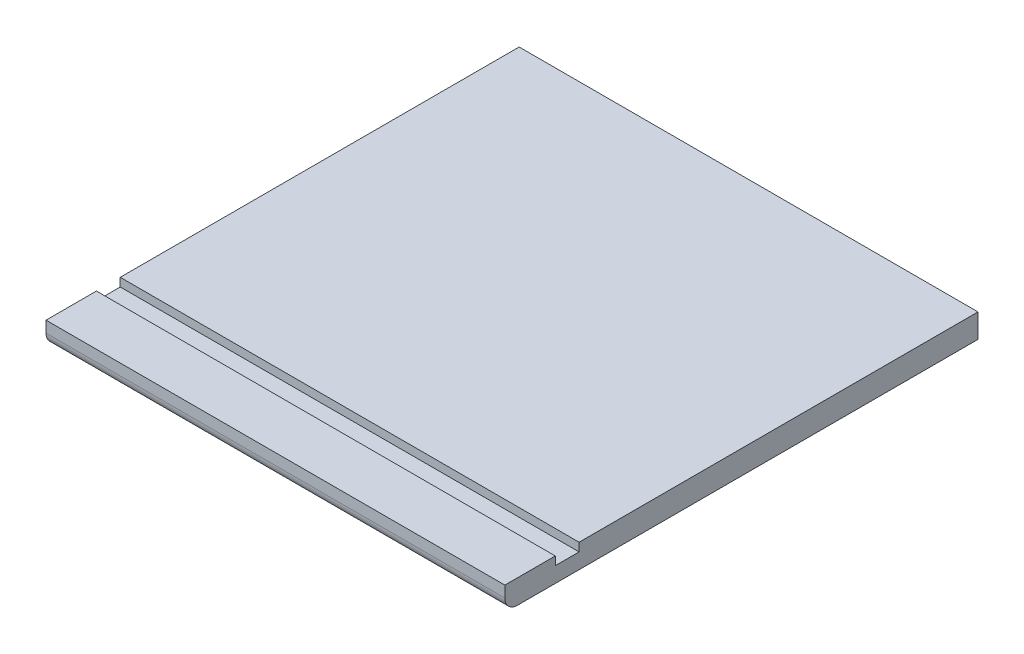
ISO-10303-21;
HEADER;
FILE_DESCRIPTION(('STEP AP214'),'2;1');
FILE_NAME('part.step','',(''),(''),'','','');
FILE_SCHEMA(('AUTOMOTIVE_DESIGN { 1 0 10303 214 1 1 1 1 }'));
ENDSEC;
DATA;
#1=APPLICATION_CONTEXT('core data for automotive mechanical design processes');
#2=APPLICATION_PROTOCOL_DEFINITION('international standard','automotive_design',2000,#1);
#3=PRODUCT_CONTEXT('',#1,'mechanical');
#4=PRODUCT('Part','Part','',(#3));
#5=PRODUCT_RELATED_PRODUCT_CATEGORY('part','',(#4));
#6=PRODUCT_DEFINITION_FORMATION('','',#4);
#7=PRODUCT_DEFINITION_CONTEXT('part definition',#1,'design');
#8=PRODUCT_DEFINITION('design','',#6,#7);
#9=PRODUCT_DEFINITION_SHAPE('','',#8);
#10=(LENGTH_UNIT() NAMED_UNIT(*) SI_UNIT(.MILLI.,.METRE.));
#11=(NAMED_UNIT(*) PLANE_ANGLE_UNIT() SI_UNIT($,.RADIAN.));
#12=(NAMED_UNIT(*) SI_UNIT($,.STERADIAN.) SOLID_ANGLE_UNIT());
#13=UNCERTAINTY_MEASURE_WITH_UNIT(LENGTH_MEASURE(1.E-05),#10,'distance_accuracy_value','');
#14=(GEOMETRIC_REPRESENTATION_CONTEXT(3) GLOBAL_UNCERTAINTY_ASSIGNED_CONTEXT((#13)) GLOBAL_UNIT_ASSIGNED_CONTEXT((#10,
#11,#12)) REPRESENTATION_CONTEXT('',''));
#15=CARTESIAN_POINT('',(0.,0.,0.));
#16=DIRECTION('',(0.,0.,1.));
#17=DIRECTION('',(1.,0.,0.));
#18=AXIS2_PLACEMENT_3D('',#15,#16,#17);
#19=CARTESIAN_POINT('',(0.,18.,0.));
#20=DIRECTION('',(0.,1.,0.));
#21=DIRECTION('',(0.,0.,1.));
#22=AXIS2_PLACEMENT_3D('',#19,#20,#21);
#23=PLANE('',#22);
#24=DIRECTION('',(1.,0.,0.));
#25=VECTOR('',#24,1.);
#26=CARTESIAN_POINT('',(346.7,18.,319.40000001));
#27=LINE('',#26,#25);
#28=CARTESIAN_POINT('',(0.,18.,319.40000001));
#29=VERTEX_POINT('',#28);
#30=CARTESIAN_POINT('',(346.7,18.,319.40000001));
#31=VERTEX_POINT('',#30);
#32=EDGE_CURVE('E121',#29,#31,#27,.T.);
#33=ORIENTED_EDGE('',*,*,#32,.F.);
#34=DIRECTION('',(0.,0.,1.));
#35=VECTOR('',#34,1.);
#36=CARTESIAN_POINT('',(0.,18.,0.));
#37=LINE('',#36,#35);
#38=CARTESIAN_POINT('',(0.,18.,357.50000001));
#39=VERTEX_POINT('',#38);
#40=EDGE_CURVE('E137',#29,#39,#37,.T.);
#41=ORIENTED_EDGE('',*,*,#40,.T.);
#42=DIRECTION('',(1.,0.,0.));
#43=VECTOR('',#42,1.);
#44=CARTESIAN_POINT('',(0.,18.,357.50000001));
#45=LINE('',#44,#43);
#46=CARTESIAN_POINT('',(346.7,18.,357.50000001));
#47=VERTEX_POINT('',#46);
#48=EDGE_CURVE('E136',#39,#47,#45,.T.);
#49=ORIENTED_EDGE('',*,*,#48,.T.);
#50=DIRECTION('',(0.,0.,-1.));
#51=VECTOR('',#50,1.);
#52=CARTESIAN_POINT('',(346.7,18.,0.));
#53=LINE('',#52,#51);
#54=EDGE_CURVE('E139',#47,#31,#53,.T.);
#55=ORIENTED_EDGE('',*,*,#54,.T.);
#56=EDGE_LOOP('',(#33,#41,#49,#55));
#57=FACE_BOUND('',#56,.T.);
#58=ADVANCED_FACE('F33',(#57),#23,.T.);
#59=CARTESIAN_POINT('',(0.,18.,0.));
#60=DIRECTION('',(1.,0.,0.));
#61=DIRECTION('',(0.,0.,-1.));
#62=AXIS2_PLACEMENT_3D('',#59,#60,#61);
#63=PLANE('',#62);
#64=DIRECTION('',(0.,0.,1.));
#65=VECTOR('',#64,1.);
#66=CARTESIAN_POINT('',(0.,0.,0.));
#67=LINE('',#66,#65);
#68=CARTESIAN_POINT('',(0.,0.,0.));
#69=VERTEX_POINT('',#68);
#70=CARTESIAN_POINT('',(0.,0.,347.97500001));
#71=VERTEX_POINT('',#70);
#72=EDGE_CURVE('E145',#69,#71,#67,.T.);
#73=ORIENTED_EDGE('',*,*,#72,.T.);
#74=CARTESIAN_POINT('',(0.,9.525,347.97500001));
#75=DIRECTION('',(1.,0.,0.));
#76=DIRECTION('',(0.,0.,-1.));
#77=AXIS2_PLACEMENT_3D('',#74,#75,#76);
#78=CIRCLE('',#77,9.525);
#79=CARTESIAN_POINT('',(0.,9.525,357.50000001));
#80=VERTEX_POINT('',#79);
#81=EDGE_CURVE('E11',#71,#80,#78,.F.);
#82=ORIENTED_EDGE('',*,*,#81,.T.);
#83=DIRECTION('',(0.,-1.,0.));
#84=VECTOR('',#83,1.);
#85=CARTESIAN_POINT('',(0.,18.,357.50000001));
#86=LINE('',#85,#84);
#87=EDGE_CURVE('E159',#39,#80,#86,.T.);
#88=ORIENTED_EDGE('',*,*,#87,.F.);
#89=ORIENTED_EDGE('',*,*,#40,.F.);
#90=DIRECTION('',(0.,1.,0.));
#91=VECTOR('',#90,1.);
#92=CARTESIAN_POINT('',(0.,11.65,319.40000001));
#93=LINE('',#92,#91);
#94=CARTESIAN_POINT('',(0.,11.65,319.40000001));
#95=VERTEX_POINT('',#94);
#96=EDGE_CURVE('E128',#95,#29,#93,.T.);
#97=ORIENTED_EDGE('',*,*,#96,.F.);
#98=DIRECTION('',(0.,0.,1.));
#99=VECTOR('',#98,1.);
#100=CARTESIAN_POINT('',(0.,11.65,319.40000001));
#101=LINE('',#100,#99);
#102=CARTESIAN_POINT('',(0.,11.65,301.40000001));
#103=VERTEX_POINT('',#102);
#104=EDGE_CURVE('E112',#103,#95,#101,.T.);
#105=ORIENTED_EDGE('',*,*,#104,.F.);
#106=DIRECTION('',(0.,1.,0.));
#107=VECTOR('',#106,1.);
#108=CARTESIAN_POINT('',(0.,11.65,301.40000001));
#109=LINE('',#108,#107);
#110=CARTESIAN_POINT('',(0.,18.,301.40000001));
#111=VERTEX_POINT('',#110);
#112=EDGE_CURVE('E109',#103,#111,#109,.T.);
#113=ORIENTED_EDGE('',*,*,#112,.T.);
#114=CARTESIAN_POINT('',(0.,18.,0.));
#115=VERTEX_POINT('',#114);
#116=EDGE_CURVE('E133',#115,#111,#37,.T.);
#117=ORIENTED_EDGE('',*,*,#116,.F.);
#118=DIRECTION('',(0.,-1.,0.));
#119=VECTOR('',#118,1.);
#120=CARTESIAN_POINT('',(0.,18.,0.));
#121=LINE('',#120,#119);
#122=EDGE_CURVE('E144',#115,#69,#121,.T.);
#123=ORIENTED_EDGE('',*,*,#122,.T.);
#124=EDGE_LOOP('',(#73,#82,#88,#89,#97,#105,#113,#117,#123));
#125=FACE_BOUND('',#124,.T.);
#126=ADVANCED_FACE('F178',(#125),#63,.F.);
#127=CARTESIAN_POINT('',(0.,18.,357.50000001));
#128=DIRECTION('',(0.,0.,-1.));
#129=DIRECTION('',(-1.,0.,0.));
#130=AXIS2_PLACEMENT_3D('',#127,#128,#129);
#131=PLANE('',#130);
#132=ORIENTED_EDGE('',*,*,#87,.T.);
#133=DIRECTION('',(1.,0.,0.));
#134=VECTOR('',#133,1.);
#135=CARTESIAN_POINT('',(0.,9.525,357.50000001));
#136=LINE('',#135,#134);
#137=CARTESIAN_POINT('',(346.7,9.525,357.50000001));
#138=VERTEX_POINT('',#137);
#139=EDGE_CURVE('E162',#80,#138,#136,.T.);
#140=ORIENTED_EDGE('',*,*,#139,.T.);
#141=DIRECTION('',(0.,-1.,0.));
#142=VECTOR('',#141,1.);
#143=CARTESIAN_POINT('',(346.7,18.,357.50000001));
#144=LINE('',#143,#142);
#145=EDGE_CURVE('E157',#47,#138,#144,.T.);
#146=ORIENTED_EDGE('',*,*,#145,.F.);
#147=ORIENTED_EDGE('',*,*,#48,.F.);
#148=EDGE_LOOP('',(#132,#140,#146,#147));
#149=FACE_BOUND('',#148,.T.);
#150=ADVANCED_FACE('F168',(#149),#131,.F.);
#151=CARTESIAN_POINT('',(346.7,18.,0.));
#152=DIRECTION('',(-1.,0.,0.));
#153=DIRECTION('',(0.,0.,1.));
#154=AXIS2_PLACEMENT_3D('',#151,#152,#153);
#155=PLANE('',#154);
#156=ORIENTED_EDGE('',*,*,#145,.T.);
#157=CARTESIAN_POINT('',(346.7,9.525,347.97500001));
#158=DIRECTION('',(-1.,0.,0.));
#159=DIRECTION('',(0.,0.,1.));
#160=AXIS2_PLACEMENT_3D('',#157,#158,#159);
#161=CIRCLE('',#160,9.525);
#162=CARTESIAN_POINT('',(346.7,0.,347.97500001));
#163=VERTEX_POINT('',#162);
#164=EDGE_CURVE('E55',#138,#163,#161,.F.);
#165=ORIENTED_EDGE('',*,*,#164,.T.);
#166=DIRECTION('',(0.,0.,-1.));
#167=VECTOR('',#166,1.);
#168=CARTESIAN_POINT('',(346.7,0.,0.));
#169=LINE('',#168,#167);
#170=CARTESIAN_POINT('',(346.7,0.,0.));
#171=VERTEX_POINT('',#170);
#172=EDGE_CURVE('E147',#163,#171,#169,.T.);
#173=ORIENTED_EDGE('',*,*,#172,.T.);
#174=DIRECTION('',(0.,-1.,0.));
#175=VECTOR('',#174,1.);
#176=CARTESIAN_POINT('',(346.7,18.,0.));
#177=LINE('',#176,#175);
#178=CARTESIAN_POINT('',(346.7,18.,0.));
#179=VERTEX_POINT('',#178);
#180=EDGE_CURVE('E154',#179,#171,#177,.T.);
#181=ORIENTED_EDGE('',*,*,#180,.F.);
#182=CARTESIAN_POINT('',(346.7,18.,301.40000001));
#183=VERTEX_POINT('',#182);
#184=EDGE_CURVE('E126',#183,#179,#53,.T.);
#185=ORIENTED_EDGE('',*,*,#184,.F.);
#186=DIRECTION('',(0.,1.,0.));
#187=VECTOR('',#186,1.);
#188=CARTESIAN_POINT('',(346.7,11.65,301.40000001));
#189=LINE('',#188,#187);
#190=CARTESIAN_POINT('',(346.7,11.65,301.40000001));
#191=VERTEX_POINT('',#190);
#192=EDGE_CURVE('E106',#191,#183,#189,.T.);
#193=ORIENTED_EDGE('',*,*,#192,.F.);
#194=DIRECTION('',(0.,0.,-1.));
#195=VECTOR('',#194,1.);
#196=CARTESIAN_POINT('',(346.7,11.65,319.40000001));
#197=LINE('',#196,#195);
#198=CARTESIAN_POINT('',(346.7,11.65,319.40000001));
#199=VERTEX_POINT('',#198);
#200=EDGE_CURVE('E113',#199,#191,#197,.T.);
#201=ORIENTED_EDGE('',*,*,#200,.F.);
#202=DIRECTION('',(0.,1.,0.));
#203=VECTOR('',#202,1.);
#204=CARTESIAN_POINT('',(346.7,11.65,319.40000001));
#205=LINE('',#204,#203);
#206=EDGE_CURVE('E148',#199,#31,#205,.T.);
#207=ORIENTED_EDGE('',*,*,#206,.T.);
#208=ORIENTED_EDGE('',*,*,#54,.F.);
#209=EDGE_LOOP('',(#156,#165,#173,#181,#185,#193,#201,#207,#208));
#210=FACE_BOUND('',#209,.T.);
#211=ADVANCED_FACE('F124',(#210),#155,.F.);
#212=CARTESIAN_POINT('',(0.,18.,0.));
#213=DIRECTION('',(0.,0.,1.));
#214=DIRECTION('',(1.,0.,0.));
#215=AXIS2_PLACEMENT_3D('',#212,#213,#214);
#216=PLANE('',#215);
#217=DIRECTION('',(-1.,0.,0.));
#218=VECTOR('',#217,1.);
#219=CARTESIAN_POINT('',(0.,0.,0.));
#220=LINE('',#219,#218);
#221=EDGE_CURVE('E150',#171,#69,#220,.T.);
#222=ORIENTED_EDGE('',*,*,#221,.T.);
#223=ORIENTED_EDGE('',*,*,#122,.F.);
#224=DIRECTION('',(-1.,0.,0.));
#225=VECTOR('',#224,1.);
#226=CARTESIAN_POINT('',(0.,18.,0.));
#227=LINE('',#226,#225);
#228=EDGE_CURVE('E142',#179,#115,#227,.T.);
#229=ORIENTED_EDGE('',*,*,#228,.F.);
#230=ORIENTED_EDGE('',*,*,#180,.T.);
#231=EDGE_LOOP('',(#222,#223,#229,#230));
#232=FACE_BOUND('',#231,.T.);
#233=ADVANCED_FACE('F196',(#232),#216,.F.);
#234=DIRECTION('',(-1.,0.,0.));
#235=VECTOR('',#234,1.);
#236=CARTESIAN_POINT('',(346.7,18.,301.40000001));
#237=LINE('',#236,#235);
#238=EDGE_CURVE('E206',#183,#111,#237,.T.);
#239=ORIENTED_EDGE('',*,*,#238,.F.);
#240=ORIENTED_EDGE('',*,*,#184,.T.);
#241=ORIENTED_EDGE('',*,*,#228,.T.);
#242=ORIENTED_EDGE('',*,*,#116,.T.);
#243=EDGE_LOOP('',(#239,#240,#241,#242));
#244=FACE_BOUND('',#243,.T.);
#245=ADVANCED_FACE('F187',(#244),#23,.T.);
#246=CARTESIAN_POINT('',(0.,0.,0.));
#247=DIRECTION('',(0.,1.,0.));
#248=DIRECTION('',(0.,0.,1.));
#249=AXIS2_PLACEMENT_3D('',#246,#247,#248);
#250=PLANE('',#249);
#251=ORIENTED_EDGE('',*,*,#172,.F.);
#252=DIRECTION('',(1.,0.,0.));
#253=VECTOR('',#252,1.);
#254=CARTESIAN_POINT('',(0.,0.,347.97500001));
#255=LINE('',#254,#253);
#256=EDGE_CURVE('E41',#163,#71,#255,.F.);
#257=ORIENTED_EDGE('',*,*,#256,.T.);
#258=ORIENTED_EDGE('',*,*,#72,.F.);
#259=ORIENTED_EDGE('',*,*,#221,.F.);
#260=EDGE_LOOP('',(#251,#257,#258,#259));
#261=FACE_BOUND('',#260,.T.);
#262=ADVANCED_FACE('F195',(#261),#250,.F.);
#263=CARTESIAN_POINT('',(346.7,11.65,319.40000001));
#264=DIRECTION('',(0.,0.,1.));
#265=DIRECTION('',(1.,0.,0.));
#266=AXIS2_PLACEMENT_3D('',#263,#264,#265);
#267=PLANE('',#266);
#268=ORIENTED_EDGE('',*,*,#32,.T.);
#269=ORIENTED_EDGE('',*,*,#206,.F.);
#270=DIRECTION('',(1.,0.,0.));
#271=VECTOR('',#270,1.);
#272=CARTESIAN_POINT('',(346.7,11.65,319.40000001));
#273=LINE('',#272,#271);
#274=EDGE_CURVE('E119',#95,#199,#273,.T.);
#275=ORIENTED_EDGE('',*,*,#274,.F.);
#276=ORIENTED_EDGE('',*,*,#96,.T.);
#277=EDGE_LOOP('',(#268,#269,#275,#276));
#278=FACE_BOUND('',#277,.T.);
#279=ADVANCED_FACE('F203',(#278),#267,.F.);
#280=CARTESIAN_POINT('',(346.7,11.65,301.40000001));
#281=DIRECTION('',(0.,0.,-1.));
#282=DIRECTION('',(-1.,0.,0.));
#283=AXIS2_PLACEMENT_3D('',#280,#281,#282);
#284=PLANE('',#283);
#285=ORIENTED_EDGE('',*,*,#238,.T.);
#286=ORIENTED_EDGE('',*,*,#112,.F.);
#287=DIRECTION('',(-1.,0.,0.));
#288=VECTOR('',#287,1.);
#289=CARTESIAN_POINT('',(346.7,11.65,301.40000001));
#290=LINE('',#289,#288);
#291=EDGE_CURVE('E102',#191,#103,#290,.T.);
#292=ORIENTED_EDGE('',*,*,#291,.F.);
#293=ORIENTED_EDGE('',*,*,#192,.T.);
#294=EDGE_LOOP('',(#285,#286,#292,#293));
#295=FACE_BOUND('',#294,.T.);
#296=ADVANCED_FACE('F104',(#295),#284,.F.);
#297=CARTESIAN_POINT('',(0.,11.65,0.));
#298=DIRECTION('',(0.,1.,0.));
#299=DIRECTION('',(0.,0.,1.));
#300=AXIS2_PLACEMENT_3D('',#297,#298,#299);
#301=PLANE('',#300);
#302=ORIENTED_EDGE('',*,*,#200,.T.);
#303=ORIENTED_EDGE('',*,*,#291,.T.);
#304=ORIENTED_EDGE('',*,*,#104,.T.);
#305=ORIENTED_EDGE('',*,*,#274,.T.);
#306=EDGE_LOOP('',(#302,#303,#304,#305));
#307=FACE_BOUND('',#306,.T.);
#308=ADVANCED_FACE('F117',(#307),#301,.T.);
#309=CARTESIAN_POINT('',(0.,9.525,347.97500001));
#310=DIRECTION('',(1.,0.,0.));
#311=DIRECTION('',(0.,0.,-1.));
#312=AXIS2_PLACEMENT_3D('',#309,#310,#311);
#313=CYLINDRICAL_SURFACE('',#312,9.525);
#314=ORIENTED_EDGE('',*,*,#81,.F.);
#315=ORIENTED_EDGE('',*,*,#256,.F.);
#316=ORIENTED_EDGE('',*,*,#164,.F.);
#317=ORIENTED_EDGE('',*,*,#139,.F.);
#318=EDGE_LOOP('',(#314,#315,#316,#317));
#319=FACE_BOUND('',#318,.T.);
#320=ADVANCED_FACE('F35',(#319),#313,.T.);
#321=CLOSED_SHELL('',(#58,#126,#150,#211,#233,#245,#262,#279,#296,#308,#320));
#322=MANIFOLD_SOLID_BREP('B2',#321);
#323=ADVANCED_BREP_SHAPE_REPRESENTATION('',(#18,#322),#14);
#324=SHAPE_DEFINITION_REPRESENTATION(#9,#323);
ENDSEC;
END-ISO-10303-21;
